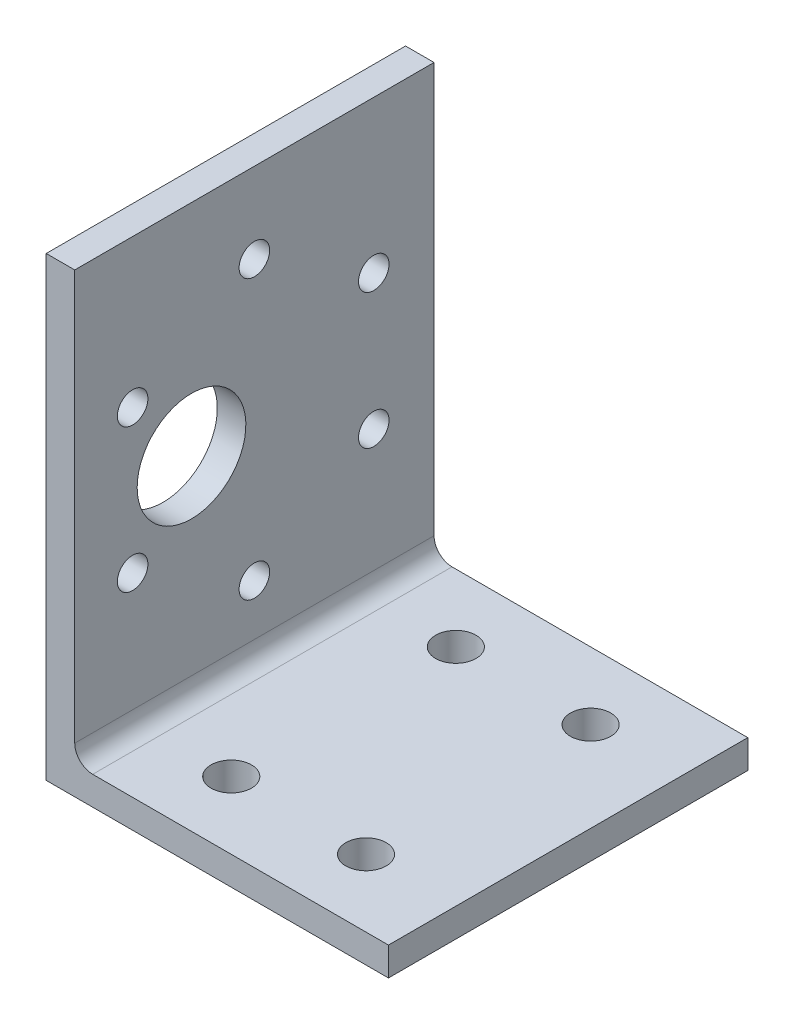
ISO-10303-21;
HEADER;
FILE_DESCRIPTION(('STEP AP214'),'2;1');
FILE_NAME('part.step','',(''),(''),'','','');
FILE_SCHEMA(('AUTOMOTIVE_DESIGN { 1 0 10303 214 1 1 1 1 }'));
ENDSEC;
DATA;
#1=APPLICATION_CONTEXT('core data for automotive mechanical design processes');
#2=APPLICATION_PROTOCOL_DEFINITION('international standard','automotive_design',2000,#1);
#3=PRODUCT_CONTEXT('',#1,'mechanical');
#4=PRODUCT('Part','Part','',(#3));
#5=PRODUCT_RELATED_PRODUCT_CATEGORY('part','',(#4));
#6=PRODUCT_DEFINITION_FORMATION('','',#4);
#7=PRODUCT_DEFINITION_CONTEXT('part definition',#1,'design');
#8=PRODUCT_DEFINITION('design','',#6,#7);
#9=PRODUCT_DEFINITION_SHAPE('','',#8);
#10=(LENGTH_UNIT() NAMED_UNIT(*) SI_UNIT(.MILLI.,.METRE.));
#11=(NAMED_UNIT(*) PLANE_ANGLE_UNIT() SI_UNIT($,.RADIAN.));
#12=(NAMED_UNIT(*) SI_UNIT($,.STERADIAN.) SOLID_ANGLE_UNIT());
#13=UNCERTAINTY_MEASURE_WITH_UNIT(LENGTH_MEASURE(1.E-05),#10,'distance_accuracy_value','');
#14=(GEOMETRIC_REPRESENTATION_CONTEXT(3) GLOBAL_UNCERTAINTY_ASSIGNED_CONTEXT((#13)) GLOBAL_UNIT_ASSIGNED_CONTEXT((#10,
#11,#12)) REPRESENTATION_CONTEXT('',''));
#15=CARTESIAN_POINT('',(0.,0.,0.));
#16=DIRECTION('',(0.,0.,1.));
#17=DIRECTION('',(1.,0.,0.));
#18=AXIS2_PLACEMENT_3D('',#15,#16,#17);
#19=CARTESIAN_POINT('',(38.1,0.,20.));
#20=DIRECTION('',(0.,1.,0.));
#21=DIRECTION('',(-1.,0.,0.));
#22=AXIS2_PLACEMENT_3D('',#19,#20,#21);
#23=PLANE('',#22);
#24=CARTESIAN_POINT('',(13.1,0.,12.5));
#25=DIRECTION('',(0.,1.,0.));
#26=DIRECTION('',(0.,0.,1.));
#27=AXIS2_PLACEMENT_3D('',#24,#25,#26);
#28=CIRCLE('',#27,2.24999999999999);
#29=CARTESIAN_POINT('',(13.1,0.,14.75));
#30=VERTEX_POINT('',#29);
#31=EDGE_CURVE('E218',#30,#30,#28,.T.);
#32=ORIENTED_EDGE('',*,*,#31,.T.);
#33=EDGE_LOOP('',(#32));
#34=FACE_BOUND('',#33,.T.);
#35=CARTESIAN_POINT('',(28.1,0.,12.5));
#36=DIRECTION('',(0.,1.,0.));
#37=DIRECTION('',(0.,0.,1.));
#38=AXIS2_PLACEMENT_3D('',#35,#36,#37);
#39=CIRCLE('',#38,2.24999999999999);
#40=CARTESIAN_POINT('',(28.1,0.,14.75));
#41=VERTEX_POINT('',#40);
#42=EDGE_CURVE('E212',#41,#41,#39,.T.);
#43=ORIENTED_EDGE('',*,*,#42,.T.);
#44=EDGE_LOOP('',(#43));
#45=FACE_BOUND('',#44,.T.);
#46=CARTESIAN_POINT('',(28.1,0.,-12.5));
#47=DIRECTION('',(0.,1.,0.));
#48=DIRECTION('',(0.,0.,1.));
#49=AXIS2_PLACEMENT_3D('',#46,#47,#48);
#50=CIRCLE('',#49,2.24999999999999);
#51=CARTESIAN_POINT('',(28.1,0.,-10.25));
#52=VERTEX_POINT('',#51);
#53=EDGE_CURVE('E206',#52,#52,#50,.T.);
#54=ORIENTED_EDGE('',*,*,#53,.T.);
#55=EDGE_LOOP('',(#54));
#56=FACE_BOUND('',#55,.T.);
#57=CARTESIAN_POINT('',(13.1,0.,-12.5));
#58=DIRECTION('',(0.,1.,0.));
#59=DIRECTION('',(0.,0.,1.));
#60=AXIS2_PLACEMENT_3D('',#57,#58,#59);
#61=CIRCLE('',#60,2.24999999999999);
#62=CARTESIAN_POINT('',(13.1,0.,-10.25));
#63=VERTEX_POINT('',#62);
#64=EDGE_CURVE('E200',#63,#63,#61,.T.);
#65=ORIENTED_EDGE('',*,*,#64,.T.);
#66=EDGE_LOOP('',(#65));
#67=FACE_BOUND('',#66,.T.);
#68=DIRECTION('',(1.,0.,0.));
#69=VECTOR('',#68,1.);
#70=CARTESIAN_POINT('',(38.1,0.,-20.));
#71=LINE('',#70,#69);
#72=CARTESIAN_POINT('',(0.,0.,-20.));
#73=VERTEX_POINT('',#72);
#74=CARTESIAN_POINT('',(38.1,0.,-20.));
#75=VERTEX_POINT('',#74);
#76=EDGE_CURVE('E126',#73,#75,#71,.T.);
#77=ORIENTED_EDGE('',*,*,#76,.T.);
#78=DIRECTION('',(0.,0.,-1.));
#79=VECTOR('',#78,1.);
#80=CARTESIAN_POINT('',(38.1,0.,20.));
#81=LINE('',#80,#79);
#82=CARTESIAN_POINT('',(38.1,0.,20.));
#83=VERTEX_POINT('',#82);
#84=EDGE_CURVE('E108',#83,#75,#81,.T.);
#85=ORIENTED_EDGE('',*,*,#84,.F.);
#86=DIRECTION('',(1.,0.,0.));
#87=VECTOR('',#86,1.);
#88=CARTESIAN_POINT('',(38.1,0.,20.));
#89=LINE('',#88,#87);
#90=CARTESIAN_POINT('',(0.,0.,20.));
#91=VERTEX_POINT('',#90);
#92=EDGE_CURVE('E114',#91,#83,#89,.T.);
#93=ORIENTED_EDGE('',*,*,#92,.F.);
#94=DIRECTION('',(0.,0.,-1.));
#95=VECTOR('',#94,1.);
#96=CARTESIAN_POINT('',(0.,0.,20.));
#97=LINE('',#96,#95);
#98=EDGE_CURVE('E140',#91,#73,#97,.T.);
#99=ORIENTED_EDGE('',*,*,#98,.T.);
#100=EDGE_LOOP('',(#77,#85,#93,#99));
#101=FACE_BOUND('',#100,.T.);
#102=ADVANCED_FACE('F45',(#34,#45,#56,#67,#101),#23,.F.);
#103=CARTESIAN_POINT('',(38.1,3.175,20.));
#104=DIRECTION('',(-1.,0.,0.));
#105=DIRECTION('',(0.,0.,1.));
#106=AXIS2_PLACEMENT_3D('',#103,#104,#105);
#107=PLANE('',#106);
#108=DIRECTION('',(0.,1.,0.));
#109=VECTOR('',#108,1.);
#110=CARTESIAN_POINT('',(38.1,3.175,-20.));
#111=LINE('',#110,#109);
#112=CARTESIAN_POINT('',(38.1,3.175,-20.));
#113=VERTEX_POINT('',#112);
#114=EDGE_CURVE('E149',#75,#113,#111,.T.);
#115=ORIENTED_EDGE('',*,*,#114,.T.);
#116=DIRECTION('',(0.,0.,-1.));
#117=VECTOR('',#116,1.);
#118=CARTESIAN_POINT('',(38.1,3.175,20.));
#119=LINE('',#118,#117);
#120=CARTESIAN_POINT('',(38.1,3.175,20.));
#121=VERTEX_POINT('',#120);
#122=EDGE_CURVE('E111',#121,#113,#119,.T.);
#123=ORIENTED_EDGE('',*,*,#122,.F.);
#124=DIRECTION('',(0.,1.,0.));
#125=VECTOR('',#124,1.);
#126=CARTESIAN_POINT('',(38.1,3.175,20.));
#127=LINE('',#126,#125);
#128=EDGE_CURVE('E104',#83,#121,#127,.T.);
#129=ORIENTED_EDGE('',*,*,#128,.F.);
#130=ORIENTED_EDGE('',*,*,#84,.T.);
#131=EDGE_LOOP('',(#115,#123,#129,#130));
#132=FACE_BOUND('',#131,.T.);
#133=ADVANCED_FACE('F106',(#132),#107,.F.);
#134=CARTESIAN_POINT('',(3.175,3.175,20.));
#135=DIRECTION('',(0.,-1.,0.));
#136=DIRECTION('',(1.,0.,0.));
#137=AXIS2_PLACEMENT_3D('',#134,#135,#136);
#138=PLANE('',#137);
#139=CARTESIAN_POINT('',(13.1,3.175,12.5));
#140=DIRECTION('',(0.,1.,0.));
#141=DIRECTION('',(0.,0.,1.));
#142=AXIS2_PLACEMENT_3D('',#139,#140,#141);
#143=CIRCLE('',#142,2.24999999999999);
#144=CARTESIAN_POINT('',(13.1,3.175,14.75));
#145=VERTEX_POINT('',#144);
#146=EDGE_CURVE('E221',#145,#145,#143,.T.);
#147=ORIENTED_EDGE('',*,*,#146,.F.);
#148=EDGE_LOOP('',(#147));
#149=FACE_BOUND('',#148,.T.);
#150=CARTESIAN_POINT('',(28.1,3.175,12.5));
#151=DIRECTION('',(0.,1.,0.));
#152=DIRECTION('',(0.,0.,1.));
#153=AXIS2_PLACEMENT_3D('',#150,#151,#152);
#154=CIRCLE('',#153,2.24999999999999);
#155=CARTESIAN_POINT('',(28.1,3.175,14.75));
#156=VERTEX_POINT('',#155);
#157=EDGE_CURVE('E215',#156,#156,#154,.T.);
#158=ORIENTED_EDGE('',*,*,#157,.F.);
#159=EDGE_LOOP('',(#158));
#160=FACE_BOUND('',#159,.T.);
#161=CARTESIAN_POINT('',(28.1,3.175,-12.5));
#162=DIRECTION('',(0.,1.,0.));
#163=DIRECTION('',(0.,0.,1.));
#164=AXIS2_PLACEMENT_3D('',#161,#162,#163);
#165=CIRCLE('',#164,2.24999999999999);
#166=CARTESIAN_POINT('',(28.1,3.175,-10.25));
#167=VERTEX_POINT('',#166);
#168=EDGE_CURVE('E209',#167,#167,#165,.T.);
#169=ORIENTED_EDGE('',*,*,#168,.F.);
#170=EDGE_LOOP('',(#169));
#171=FACE_BOUND('',#170,.T.);
#172=CARTESIAN_POINT('',(13.1,3.175,-12.5));
#173=DIRECTION('',(0.,1.,0.));
#174=DIRECTION('',(0.,0.,1.));
#175=AXIS2_PLACEMENT_3D('',#172,#173,#174);
#176=CIRCLE('',#175,2.24999999999999);
#177=CARTESIAN_POINT('',(13.1,3.175,-10.25));
#178=VERTEX_POINT('',#177);
#179=EDGE_CURVE('E203',#178,#178,#176,.T.);
#180=ORIENTED_EDGE('',*,*,#179,.F.);
#181=EDGE_LOOP('',(#180));
#182=FACE_BOUND('',#181,.T.);
#183=DIRECTION('',(-1.,0.,0.));
#184=VECTOR('',#183,1.);
#185=CARTESIAN_POINT('',(3.175,3.175,-20.));
#186=LINE('',#185,#184);
#187=CARTESIAN_POINT('',(5.175,3.175,-20.));
#188=VERTEX_POINT('',#187);
#189=EDGE_CURVE('E147',#113,#188,#186,.T.);
#190=ORIENTED_EDGE('',*,*,#189,.T.);
#191=DIRECTION('',(0.,0.,-1.));
#192=VECTOR('',#191,1.);
#193=CARTESIAN_POINT('',(5.175,3.175,20.));
#194=LINE('',#193,#192);
#195=CARTESIAN_POINT('',(5.175,3.175,20.));
#196=VERTEX_POINT('',#195);
#197=EDGE_CURVE('E60',#188,#196,#194,.F.);
#198=ORIENTED_EDGE('',*,*,#197,.T.);
#199=DIRECTION('',(-1.,0.,0.));
#200=VECTOR('',#199,1.);
#201=CARTESIAN_POINT('',(3.175,3.175,20.));
#202=LINE('',#201,#200);
#203=EDGE_CURVE('E113',#121,#196,#202,.T.);
#204=ORIENTED_EDGE('',*,*,#203,.F.);
#205=ORIENTED_EDGE('',*,*,#122,.T.);
#206=EDGE_LOOP('',(#190,#198,#204,#205));
#207=FACE_BOUND('',#206,.T.);
#208=ADVANCED_FACE('F227',(#149,#160,#171,#182,#207),#138,.F.);
#209=CARTESIAN_POINT('',(3.175,50.8,20.));
#210=DIRECTION('',(-1.,0.,0.));
#211=DIRECTION('',(0.,-1.,0.));
#212=AXIS2_PLACEMENT_3D('',#209,#210,#211);
#213=PLANE('',#212);
#214=CARTESIAN_POINT('',(3.175,26.35,7.));
#215=DIRECTION('',(-1.,0.,0.));
#216=DIRECTION('',(0.,-1.,0.));
#217=AXIS2_PLACEMENT_3D('',#214,#215,#216);
#218=CIRCLE('',#217,6.05);
#219=CARTESIAN_POINT('',(3.175,20.3,7.));
#220=VERTEX_POINT('',#219);
#221=EDGE_CURVE('E194',#220,#220,#218,.T.);
#222=ORIENTED_EDGE('',*,*,#221,.T.);
#223=EDGE_LOOP('',(#222));
#224=FACE_BOUND('',#223,.T.);
#225=CARTESIAN_POINT('',(3.175,41.847738991354,0.));
#226=DIRECTION('',(-1.,0.,0.));
#227=DIRECTION('',(0.,-1.,0.));
#228=AXIS2_PLACEMENT_3D('',#225,#226,#227);
#229=CIRCLE('',#228,1.7);
#230=CARTESIAN_POINT('',(3.175,40.147738991354,0.));
#231=VERTEX_POINT('',#230);
#232=EDGE_CURVE('E188',#231,#231,#229,.T.);
#233=ORIENTED_EDGE('',*,*,#232,.T.);
#234=EDGE_LOOP('',(#233));
#235=FACE_BOUND('',#234,.T.);
#236=CARTESIAN_POINT('',(3.175,34.3281392426975,13.5538046178926));
#237=DIRECTION('',(-1.,0.,0.));
#238=DIRECTION('',(0.,-1.,0.));
#239=AXIS2_PLACEMENT_3D('',#236,#237,#238);
#240=CIRCLE('',#239,1.7);
#241=CARTESIAN_POINT('',(3.175,32.6281392426975,13.5538046178926));
#242=VERTEX_POINT('',#241);
#243=EDGE_CURVE('E182',#242,#242,#240,.T.);
#244=ORIENTED_EDGE('',*,*,#243,.T.);
#245=EDGE_LOOP('',(#244));
#246=FACE_BOUND('',#245,.T.);
#247=CARTESIAN_POINT('',(3.175,18.8304002513436,-13.2890667175739));
#248=DIRECTION('',(-1.,0.,0.));
#249=DIRECTION('',(0.,-1.,0.));
#250=AXIS2_PLACEMENT_3D('',#247,#248,#249);
#251=CIRCLE('',#250,1.7);
#252=CARTESIAN_POINT('',(3.175,17.1304002513436,-13.2890667175739));
#253=VERTEX_POINT('',#252);
#254=EDGE_CURVE('E176',#253,#253,#251,.T.);
#255=ORIENTED_EDGE('',*,*,#254,.T.);
#256=EDGE_LOOP('',(#255));
#257=FACE_BOUND('',#256,.T.);
#258=CARTESIAN_POINT('',(3.175,10.852261008646,0.));
#259=DIRECTION('',(-1.,0.,0.));
#260=DIRECTION('',(0.,-1.,0.));
#261=AXIS2_PLACEMENT_3D('',#258,#259,#260);
#262=CIRCLE('',#261,1.7);
#263=CARTESIAN_POINT('',(3.175,9.15226100864598,0.));
#264=VERTEX_POINT('',#263);
#265=EDGE_CURVE('E170',#264,#264,#262,.T.);
#266=ORIENTED_EDGE('',*,*,#265,.T.);
#267=EDGE_LOOP('',(#266));
#268=FACE_BOUND('',#267,.T.);
#269=CARTESIAN_POINT('',(3.175,33.8695997486564,-13.2890667175739));
#270=DIRECTION('',(-1.,0.,0.));
#271=DIRECTION('',(0.,-1.,0.));
#272=AXIS2_PLACEMENT_3D('',#269,#270,#271);
#273=CIRCLE('',#272,1.7);
#274=CARTESIAN_POINT('',(3.175,32.1695997486565,-13.2890667175739));
#275=VERTEX_POINT('',#274);
#276=EDGE_CURVE('E164',#275,#275,#273,.T.);
#277=ORIENTED_EDGE('',*,*,#276,.T.);
#278=EDGE_LOOP('',(#277));
#279=FACE_BOUND('',#278,.T.);
#280=CARTESIAN_POINT('',(3.175,18.3718607573025,13.5538046178926));
#281=DIRECTION('',(-1.,0.,0.));
#282=DIRECTION('',(0.,-1.,0.));
#283=AXIS2_PLACEMENT_3D('',#280,#281,#282);
#284=CIRCLE('',#283,1.7);
#285=CARTESIAN_POINT('',(3.175,16.6718607573025,13.5538046178926));
#286=VERTEX_POINT('',#285);
#287=EDGE_CURVE('E152',#286,#286,#284,.T.);
#288=ORIENTED_EDGE('',*,*,#287,.T.);
#289=EDGE_LOOP('',(#288));
#290=FACE_BOUND('',#289,.T.);
#291=DIRECTION('',(0.,1.,0.));
#292=VECTOR('',#291,1.);
#293=CARTESIAN_POINT('',(3.175,50.8,20.));
#294=LINE('',#293,#292);
#295=CARTESIAN_POINT('',(3.175,5.175,20.));
#296=VERTEX_POINT('',#295);
#297=CARTESIAN_POINT('',(3.175,50.8,20.));
#298=VERTEX_POINT('',#297);
#299=EDGE_CURVE('E156',#296,#298,#294,.T.);
#300=ORIENTED_EDGE('',*,*,#299,.F.);
#301=DIRECTION('',(0.,0.,-1.));
#302=VECTOR('',#301,1.);
#303=CARTESIAN_POINT('',(3.175,5.175,-20.));
#304=LINE('',#303,#302);
#305=CARTESIAN_POINT('',(3.175,5.175,-20.));
#306=VERTEX_POINT('',#305);
#307=EDGE_CURVE('E127',#296,#306,#304,.T.);
#308=ORIENTED_EDGE('',*,*,#307,.T.);
#309=DIRECTION('',(0.,1.,0.));
#310=VECTOR('',#309,1.);
#311=CARTESIAN_POINT('',(3.175,50.8,-20.));
#312=LINE('',#311,#310);
#313=CARTESIAN_POINT('',(3.175,50.8,-20.));
#314=VERTEX_POINT('',#313);
#315=EDGE_CURVE('E145',#306,#314,#312,.T.);
#316=ORIENTED_EDGE('',*,*,#315,.T.);
#317=DIRECTION('',(0.,0.,-1.));
#318=VECTOR('',#317,1.);
#319=CARTESIAN_POINT('',(3.175,50.8,20.));
#320=LINE('',#319,#318);
#321=EDGE_CURVE('E131',#298,#314,#320,.T.);
#322=ORIENTED_EDGE('',*,*,#321,.F.);
#323=EDGE_LOOP('',(#300,#308,#316,#322));
#324=FACE_BOUND('',#323,.T.);
#325=ADVANCED_FACE('F230',(#224,#235,#246,#257,#268,#279,#290,#324),#213,.F.);
#326=CARTESIAN_POINT('',(0.,50.8,20.));
#327=DIRECTION('',(0.,-1.,0.));
#328=DIRECTION('',(0.,0.,-1.));
#329=AXIS2_PLACEMENT_3D('',#326,#327,#328);
#330=PLANE('',#329);
#331=DIRECTION('',(-1.,0.,0.));
#332=VECTOR('',#331,1.);
#333=CARTESIAN_POINT('',(0.,50.8,-20.));
#334=LINE('',#333,#332);
#335=CARTESIAN_POINT('',(0.,50.8,-20.));
#336=VERTEX_POINT('',#335);
#337=EDGE_CURVE('E143',#314,#336,#334,.T.);
#338=ORIENTED_EDGE('',*,*,#337,.T.);
#339=DIRECTION('',(0.,0.,-1.));
#340=VECTOR('',#339,1.);
#341=CARTESIAN_POINT('',(0.,50.8,20.));
#342=LINE('',#341,#340);
#343=CARTESIAN_POINT('',(0.,50.8,20.));
#344=VERTEX_POINT('',#343);
#345=EDGE_CURVE('E137',#344,#336,#342,.T.);
#346=ORIENTED_EDGE('',*,*,#345,.F.);
#347=DIRECTION('',(-1.,0.,0.));
#348=VECTOR('',#347,1.);
#349=CARTESIAN_POINT('',(0.,50.8,20.));
#350=LINE('',#349,#348);
#351=EDGE_CURVE('E154',#298,#344,#350,.T.);
#352=ORIENTED_EDGE('',*,*,#351,.F.);
#353=ORIENTED_EDGE('',*,*,#321,.T.);
#354=EDGE_LOOP('',(#338,#346,#352,#353));
#355=FACE_BOUND('',#354,.T.);
#356=ADVANCED_FACE('F247',(#355),#330,.F.);
#357=CARTESIAN_POINT('',(0.,0.,20.));
#358=DIRECTION('',(1.,0.,0.));
#359=DIRECTION('',(0.,0.,-1.));
#360=AXIS2_PLACEMENT_3D('',#357,#358,#359);
#361=PLANE('',#360);
#362=CARTESIAN_POINT('',(0.,26.35,7.));
#363=DIRECTION('',(-1.,0.,0.));
#364=DIRECTION('',(0.,0.,1.));
#365=AXIS2_PLACEMENT_3D('',#362,#363,#364);
#366=CIRCLE('',#365,6.05);
#367=CARTESIAN_POINT('',(0.,26.35,13.05));
#368=VERTEX_POINT('',#367);
#369=EDGE_CURVE('E197',#368,#368,#366,.T.);
#370=ORIENTED_EDGE('',*,*,#369,.F.);
#371=EDGE_LOOP('',(#370));
#372=FACE_BOUND('',#371,.T.);
#373=CARTESIAN_POINT('',(0.,41.847738991354,0.));
#374=DIRECTION('',(-1.,0.,0.));
#375=DIRECTION('',(0.,0.,1.));
#376=AXIS2_PLACEMENT_3D('',#373,#374,#375);
#377=CIRCLE('',#376,1.7);
#378=CARTESIAN_POINT('',(0.,41.847738991354,1.7));
#379=VERTEX_POINT('',#378);
#380=EDGE_CURVE('E191',#379,#379,#377,.T.);
#381=ORIENTED_EDGE('',*,*,#380,.F.);
#382=EDGE_LOOP('',(#381));
#383=FACE_BOUND('',#382,.T.);
#384=CARTESIAN_POINT('',(0.,34.3281392426975,13.5538046178926));
#385=DIRECTION('',(-1.,0.,0.));
#386=DIRECTION('',(0.,0.,1.));
#387=AXIS2_PLACEMENT_3D('',#384,#385,#386);
#388=CIRCLE('',#387,1.7);
#389=CARTESIAN_POINT('',(0.,34.3281392426975,15.2538046178926));
#390=VERTEX_POINT('',#389);
#391=EDGE_CURVE('E185',#390,#390,#388,.T.);
#392=ORIENTED_EDGE('',*,*,#391,.F.);
#393=EDGE_LOOP('',(#392));
#394=FACE_BOUND('',#393,.T.);
#395=CARTESIAN_POINT('',(0.,18.8304002513436,-13.2890667175739));
#396=DIRECTION('',(-1.,0.,0.));
#397=DIRECTION('',(0.,0.,1.));
#398=AXIS2_PLACEMENT_3D('',#395,#396,#397);
#399=CIRCLE('',#398,1.7);
#400=CARTESIAN_POINT('',(0.,18.8304002513436,-11.5890667175739));
#401=VERTEX_POINT('',#400);
#402=EDGE_CURVE('E179',#401,#401,#399,.T.);
#403=ORIENTED_EDGE('',*,*,#402,.F.);
#404=EDGE_LOOP('',(#403));
#405=FACE_BOUND('',#404,.T.);
#406=CARTESIAN_POINT('',(0.,10.852261008646,0.));
#407=DIRECTION('',(-1.,0.,0.));
#408=DIRECTION('',(0.,0.,1.));
#409=AXIS2_PLACEMENT_3D('',#406,#407,#408);
#410=CIRCLE('',#409,1.7);
#411=CARTESIAN_POINT('',(0.,10.852261008646,1.7));
#412=VERTEX_POINT('',#411);
#413=EDGE_CURVE('E173',#412,#412,#410,.T.);
#414=ORIENTED_EDGE('',*,*,#413,.F.);
#415=EDGE_LOOP('',(#414));
#416=FACE_BOUND('',#415,.T.);
#417=CARTESIAN_POINT('',(0.,33.8695997486564,-13.2890667175739));
#418=DIRECTION('',(-1.,0.,0.));
#419=DIRECTION('',(0.,0.,1.));
#420=AXIS2_PLACEMENT_3D('',#417,#418,#419);
#421=CIRCLE('',#420,1.7);
#422=CARTESIAN_POINT('',(0.,33.8695997486564,-11.5890667175739));
#423=VERTEX_POINT('',#422);
#424=EDGE_CURVE('E167',#423,#423,#421,.T.);
#425=ORIENTED_EDGE('',*,*,#424,.F.);
#426=EDGE_LOOP('',(#425));
#427=FACE_BOUND('',#426,.T.);
#428=CARTESIAN_POINT('',(0.,18.3718607573025,13.5538046178926));
#429=DIRECTION('',(-1.,0.,0.));
#430=DIRECTION('',(0.,0.,1.));
#431=AXIS2_PLACEMENT_3D('',#428,#429,#430);
#432=CIRCLE('',#431,1.7);
#433=CARTESIAN_POINT('',(0.,18.3718607573025,15.2538046178926));
#434=VERTEX_POINT('',#433);
#435=EDGE_CURVE('E161',#434,#434,#432,.T.);
#436=ORIENTED_EDGE('',*,*,#435,.F.);
#437=EDGE_LOOP('',(#436));
#438=FACE_BOUND('',#437,.T.);
#439=DIRECTION('',(0.,-1.,0.));
#440=VECTOR('',#439,1.);
#441=CARTESIAN_POINT('',(0.,0.,-20.));
#442=LINE('',#441,#440);
#443=EDGE_CURVE('E123',#336,#73,#442,.T.);
#444=ORIENTED_EDGE('',*,*,#443,.T.);
#445=ORIENTED_EDGE('',*,*,#98,.F.);
#446=DIRECTION('',(0.,-1.,0.));
#447=VECTOR('',#446,1.);
#448=CARTESIAN_POINT('',(0.,0.,20.));
#449=LINE('',#448,#447);
#450=EDGE_CURVE('E119',#344,#91,#449,.T.);
#451=ORIENTED_EDGE('',*,*,#450,.F.);
#452=ORIENTED_EDGE('',*,*,#345,.T.);
#453=EDGE_LOOP('',(#444,#445,#451,#452));
#454=FACE_BOUND('',#453,.T.);
#455=ADVANCED_FACE('F250',(#372,#383,#394,#405,#416,#427,#438,#454),#361,.F.);
#456=CARTESIAN_POINT('',(0.,0.,20.));
#457=DIRECTION('',(0.,0.,-1.));
#458=DIRECTION('',(-1.,0.,0.));
#459=AXIS2_PLACEMENT_3D('',#456,#457,#458);
#460=PLANE('',#459);
#461=ORIENTED_EDGE('',*,*,#92,.T.);
#462=ORIENTED_EDGE('',*,*,#128,.T.);
#463=ORIENTED_EDGE('',*,*,#203,.T.);
#464=CARTESIAN_POINT('',(5.175,5.175,20.));
#465=DIRECTION('',(0.,0.,-1.));
#466=DIRECTION('',(-1.,0.,0.));
#467=AXIS2_PLACEMENT_3D('',#464,#465,#466);
#468=CIRCLE('',#467,2.);
#469=EDGE_CURVE('E11',#196,#296,#468,.T.);
#470=ORIENTED_EDGE('',*,*,#469,.T.);
#471=ORIENTED_EDGE('',*,*,#299,.T.);
#472=ORIENTED_EDGE('',*,*,#351,.T.);
#473=ORIENTED_EDGE('',*,*,#450,.T.);
#474=EDGE_LOOP('',(#461,#462,#463,#470,#471,#472,#473));
#475=FACE_BOUND('',#474,.T.);
#476=ADVANCED_FACE('F117',(#475),#460,.F.);
#477=CARTESIAN_POINT('',(0.,0.,-20.));
#478=DIRECTION('',(0.,0.,-1.));
#479=DIRECTION('',(-1.,0.,0.));
#480=AXIS2_PLACEMENT_3D('',#477,#478,#479);
#481=PLANE('',#480);
#482=ORIENTED_EDGE('',*,*,#76,.F.);
#483=ORIENTED_EDGE('',*,*,#443,.F.);
#484=ORIENTED_EDGE('',*,*,#337,.F.);
#485=ORIENTED_EDGE('',*,*,#315,.F.);
#486=CARTESIAN_POINT('',(5.175,5.175,-20.));
#487=DIRECTION('',(0.,0.,-1.));
#488=DIRECTION('',(-1.,0.,0.));
#489=AXIS2_PLACEMENT_3D('',#486,#487,#488);
#490=CIRCLE('',#489,2.);
#491=EDGE_CURVE('E53',#306,#188,#490,.F.);
#492=ORIENTED_EDGE('',*,*,#491,.T.);
#493=ORIENTED_EDGE('',*,*,#189,.F.);
#494=ORIENTED_EDGE('',*,*,#114,.F.);
#495=EDGE_LOOP('',(#482,#483,#484,#485,#492,#493,#494));
#496=FACE_BOUND('',#495,.T.);
#497=ADVANCED_FACE('F251',(#496),#481,.T.);
#498=CARTESIAN_POINT('',(5.175,5.175,20.));
#499=DIRECTION('',(0.,0.,1.));
#500=DIRECTION('',(1.,0.,0.));
#501=AXIS2_PLACEMENT_3D('',#498,#499,#500);
#502=CYLINDRICAL_SURFACE('',#501,2.);
#503=ORIENTED_EDGE('',*,*,#469,.F.);
#504=ORIENTED_EDGE('',*,*,#197,.F.);
#505=ORIENTED_EDGE('',*,*,#491,.F.);
#506=ORIENTED_EDGE('',*,*,#307,.F.);
#507=EDGE_LOOP('',(#503,#504,#505,#506));
#508=FACE_BOUND('',#507,.T.);
#509=ADVANCED_FACE('F47',(#508),#502,.F.);
#510=CARTESIAN_POINT('',(0.,18.3718607573025,13.5538046178926));
#511=DIRECTION('',(-1.,0.,0.));
#512=DIRECTION('',(0.,0.,1.));
#513=AXIS2_PLACEMENT_3D('',#510,#511,#512);
#514=CYLINDRICAL_SURFACE('',#513,1.7);
#515=ORIENTED_EDGE('',*,*,#435,.T.);
#516=EDGE_LOOP('',(#515));
#517=FACE_BOUND('',#516,.T.);
#518=ORIENTED_EDGE('',*,*,#287,.F.);
#519=EDGE_LOOP('',(#518));
#520=FACE_BOUND('',#519,.T.);
#521=ADVANCED_FACE('F258',(#517,#520),#514,.F.);
#522=CARTESIAN_POINT('',(0.,33.8695997486564,-13.2890667175739));
#523=DIRECTION('',(-1.,0.,0.));
#524=DIRECTION('',(0.,0.,1.));
#525=AXIS2_PLACEMENT_3D('',#522,#523,#524);
#526=CYLINDRICAL_SURFACE('',#525,1.7);
#527=ORIENTED_EDGE('',*,*,#424,.T.);
#528=EDGE_LOOP('',(#527));
#529=FACE_BOUND('',#528,.T.);
#530=ORIENTED_EDGE('',*,*,#276,.F.);
#531=EDGE_LOOP('',(#530));
#532=FACE_BOUND('',#531,.T.);
#533=ADVANCED_FACE('F294',(#529,#532),#526,.F.);
#534=CARTESIAN_POINT('',(0.,10.852261008646,0.));
#535=DIRECTION('',(-1.,0.,0.));
#536=DIRECTION('',(0.,0.,1.));
#537=AXIS2_PLACEMENT_3D('',#534,#535,#536);
#538=CYLINDRICAL_SURFACE('',#537,1.7);
#539=ORIENTED_EDGE('',*,*,#413,.T.);
#540=EDGE_LOOP('',(#539));
#541=FACE_BOUND('',#540,.T.);
#542=ORIENTED_EDGE('',*,*,#265,.F.);
#543=EDGE_LOOP('',(#542));
#544=FACE_BOUND('',#543,.T.);
#545=ADVANCED_FACE('F301',(#541,#544),#538,.F.);
#546=CARTESIAN_POINT('',(0.,18.8304002513436,-13.2890667175739));
#547=DIRECTION('',(-1.,0.,0.));
#548=DIRECTION('',(0.,0.,1.));
#549=AXIS2_PLACEMENT_3D('',#546,#547,#548);
#550=CYLINDRICAL_SURFACE('',#549,1.7);
#551=ORIENTED_EDGE('',*,*,#402,.T.);
#552=EDGE_LOOP('',(#551));
#553=FACE_BOUND('',#552,.T.);
#554=ORIENTED_EDGE('',*,*,#254,.F.);
#555=EDGE_LOOP('',(#554));
#556=FACE_BOUND('',#555,.T.);
#557=ADVANCED_FACE('F307',(#553,#556),#550,.F.);
#558=CARTESIAN_POINT('',(0.,34.3281392426975,13.5538046178926));
#559=DIRECTION('',(-1.,0.,0.));
#560=DIRECTION('',(0.,0.,1.));
#561=AXIS2_PLACEMENT_3D('',#558,#559,#560);
#562=CYLINDRICAL_SURFACE('',#561,1.7);
#563=ORIENTED_EDGE('',*,*,#391,.T.);
#564=EDGE_LOOP('',(#563));
#565=FACE_BOUND('',#564,.T.);
#566=ORIENTED_EDGE('',*,*,#243,.F.);
#567=EDGE_LOOP('',(#566));
#568=FACE_BOUND('',#567,.T.);
#569=ADVANCED_FACE('F311',(#565,#568),#562,.F.);
#570=CARTESIAN_POINT('',(0.,41.847738991354,0.));
#571=DIRECTION('',(-1.,0.,0.));
#572=DIRECTION('',(0.,0.,1.));
#573=AXIS2_PLACEMENT_3D('',#570,#571,#572);
#574=CYLINDRICAL_SURFACE('',#573,1.7);
#575=ORIENTED_EDGE('',*,*,#380,.T.);
#576=EDGE_LOOP('',(#575));
#577=FACE_BOUND('',#576,.T.);
#578=ORIENTED_EDGE('',*,*,#232,.F.);
#579=EDGE_LOOP('',(#578));
#580=FACE_BOUND('',#579,.T.);
#581=ADVANCED_FACE('F315',(#577,#580),#574,.F.);
#582=CARTESIAN_POINT('',(38.1,26.35,7.));
#583=DIRECTION('',(-1.,0.,0.));
#584=DIRECTION('',(0.,0.,1.));
#585=AXIS2_PLACEMENT_3D('',#582,#583,#584);
#586=CYLINDRICAL_SURFACE('',#585,6.05);
#587=ORIENTED_EDGE('',*,*,#369,.T.);
#588=EDGE_LOOP('',(#587));
#589=FACE_BOUND('',#588,.T.);
#590=ORIENTED_EDGE('',*,*,#221,.F.);
#591=EDGE_LOOP('',(#590));
#592=FACE_BOUND('',#591,.T.);
#593=ADVANCED_FACE('F319',(#589,#592),#586,.F.);
#594=CARTESIAN_POINT('',(13.1,3.175,-12.5));
#595=DIRECTION('',(0.,1.,0.));
#596=DIRECTION('',(0.,0.,1.));
#597=AXIS2_PLACEMENT_3D('',#594,#595,#596);
#598=CYLINDRICAL_SURFACE('',#597,2.24999999999999);
#599=ORIENTED_EDGE('',*,*,#64,.F.);
#600=EDGE_LOOP('',(#599));
#601=FACE_BOUND('',#600,.T.);
#602=ORIENTED_EDGE('',*,*,#179,.T.);
#603=EDGE_LOOP('',(#602));
#604=FACE_BOUND('',#603,.T.);
#605=ADVANCED_FACE('F322',(#601,#604),#598,.F.);
#606=CARTESIAN_POINT('',(28.1,3.175,-12.5));
#607=DIRECTION('',(0.,1.,0.));
#608=DIRECTION('',(0.,0.,1.));
#609=AXIS2_PLACEMENT_3D('',#606,#607,#608);
#610=CYLINDRICAL_SURFACE('',#609,2.24999999999999);
#611=ORIENTED_EDGE('',*,*,#53,.F.);
#612=EDGE_LOOP('',(#611));
#613=FACE_BOUND('',#612,.T.);
#614=ORIENTED_EDGE('',*,*,#168,.T.);
#615=EDGE_LOOP('',(#614));
#616=FACE_BOUND('',#615,.T.);
#617=ADVANCED_FACE('F326',(#613,#616),#610,.F.);
#618=CARTESIAN_POINT('',(28.1,3.175,12.5));
#619=DIRECTION('',(0.,1.,0.));
#620=DIRECTION('',(0.,0.,1.));
#621=AXIS2_PLACEMENT_3D('',#618,#619,#620);
#622=CYLINDRICAL_SURFACE('',#621,2.24999999999999);
#623=ORIENTED_EDGE('',*,*,#42,.F.);
#624=EDGE_LOOP('',(#623));
#625=FACE_BOUND('',#624,.T.);
#626=ORIENTED_EDGE('',*,*,#157,.T.);
#627=EDGE_LOOP('',(#626));
#628=FACE_BOUND('',#627,.T.);
#629=ADVANCED_FACE('F330',(#625,#628),#622,.F.);
#630=CARTESIAN_POINT('',(13.1,3.175,12.5));
#631=DIRECTION('',(0.,1.,0.));
#632=DIRECTION('',(0.,0.,1.));
#633=AXIS2_PLACEMENT_3D('',#630,#631,#632);
#634=CYLINDRICAL_SURFACE('',#633,2.24999999999999);
#635=ORIENTED_EDGE('',*,*,#31,.F.);
#636=EDGE_LOOP('',(#635));
#637=FACE_BOUND('',#636,.T.);
#638=ORIENTED_EDGE('',*,*,#146,.T.);
#639=EDGE_LOOP('',(#638));
#640=FACE_BOUND('',#639,.T.);
#641=ADVANCED_FACE('F225',(#637,#640),#634,.F.);
#642=CLOSED_SHELL('',(#102,#133,#208,#325,#356,#455,#476,#497,#509,#521,#533,#545,#557,#569,
#581,#593,#605,#617,#629,#641));
#643=MANIFOLD_SOLID_BREP('B2',#642);
#644=ADVANCED_BREP_SHAPE_REPRESENTATION('',(#18,#643),#14);
#645=SHAPE_DEFINITION_REPRESENTATION(#9,#644);
ENDSEC;
END-ISO-10303-21;
